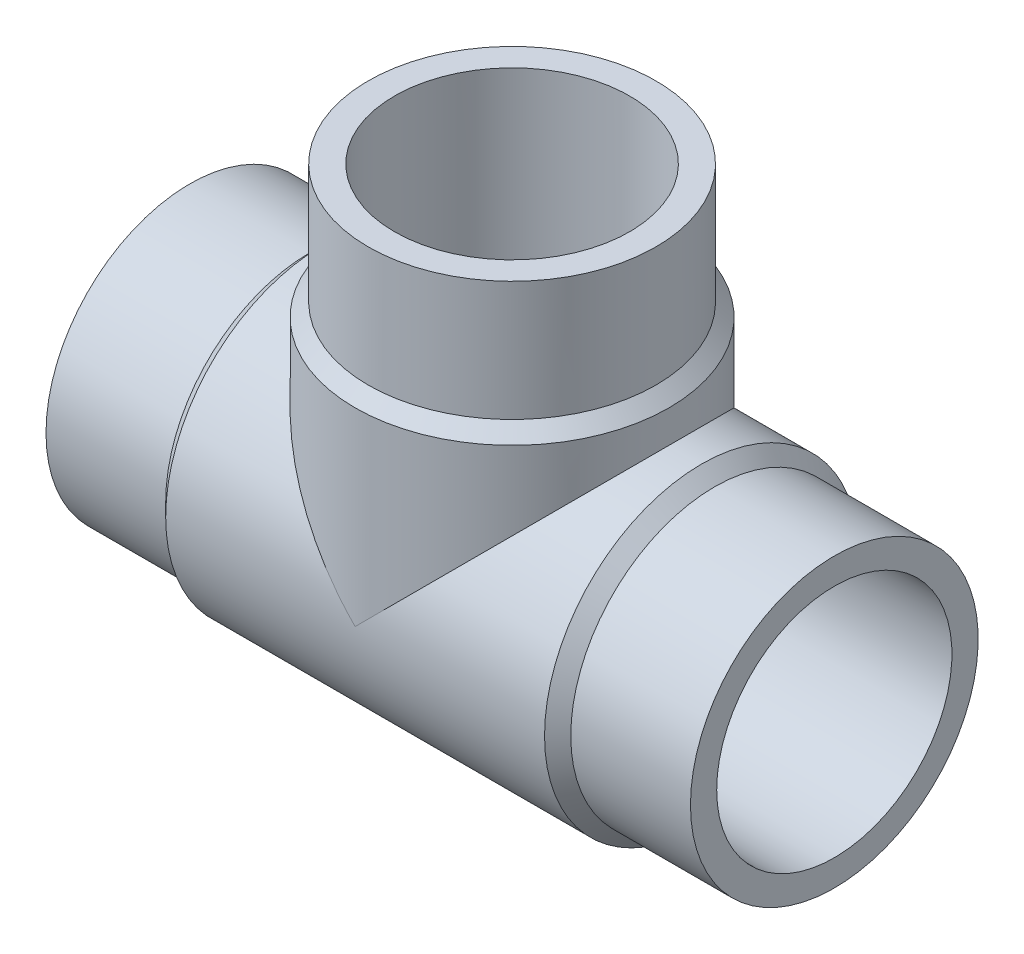
ISO-10303-21;
HEADER;
FILE_DESCRIPTION(('STEP AP214'),'2;1');
FILE_NAME('part.step','',(''),(''),'','','');
FILE_SCHEMA(('AUTOMOTIVE_DESIGN { 1 0 10303 214 1 1 1 1 }'));
ENDSEC;
DATA;
#1=APPLICATION_CONTEXT('core data for automotive mechanical design processes');
#2=APPLICATION_PROTOCOL_DEFINITION('international standard','automotive_design',2000,#1);
#3=PRODUCT_CONTEXT('',#1,'mechanical');
#4=PRODUCT('Part','Part','',(#3));
#5=PRODUCT_RELATED_PRODUCT_CATEGORY('part','',(#4));
#6=PRODUCT_DEFINITION_FORMATION('','',#4);
#7=PRODUCT_DEFINITION_CONTEXT('part definition',#1,'design');
#8=PRODUCT_DEFINITION('design','',#6,#7);
#9=PRODUCT_DEFINITION_SHAPE('','',#8);
#10=(LENGTH_UNIT() NAMED_UNIT(*) SI_UNIT(.MILLI.,.METRE.));
#11=(NAMED_UNIT(*) PLANE_ANGLE_UNIT() SI_UNIT($,.RADIAN.));
#12=(NAMED_UNIT(*) SI_UNIT($,.STERADIAN.) SOLID_ANGLE_UNIT());
#13=UNCERTAINTY_MEASURE_WITH_UNIT(LENGTH_MEASURE(1.E-05),#10,'distance_accuracy_value','');
#14=(GEOMETRIC_REPRESENTATION_CONTEXT(3) GLOBAL_UNCERTAINTY_ASSIGNED_CONTEXT((#13)) GLOBAL_UNIT_ASSIGNED_CONTEXT((#10,
#11,#12)) REPRESENTATION_CONTEXT('',''));
#15=CARTESIAN_POINT('',(0.,0.,0.));
#16=DIRECTION('',(0.,0.,1.));
#17=DIRECTION('',(1.,0.,0.));
#18=AXIS2_PLACEMENT_3D('',#15,#16,#17);
#19=CARTESIAN_POINT('',(-140.,140.,0.));
#20=DIRECTION('',(0.,1.,0.));
#21=DIRECTION('',(0.,0.,1.));
#22=AXIS2_PLACEMENT_3D('',#19,#20,#21);
#23=CYLINDRICAL_SURFACE('',#22,62.5);
#24=CARTESIAN_POINT('',(-140.,140.,0.));
#25=DIRECTION('',(0.,1.,0.));
#26=DIRECTION('',(0.,0.,1.));
#27=AXIS2_PLACEMENT_3D('',#24,#25,#26);
#28=CIRCLE('',#27,62.5);
#29=CARTESIAN_POINT('',(-140.,140.,62.5));
#30=VERTEX_POINT('',#29);
#31=EDGE_CURVE('E18',#30,#30,#28,.T.);
#32=ORIENTED_EDGE('',*,*,#31,.F.);
#33=EDGE_LOOP('',(#32));
#34=FACE_BOUND('',#33,.T.);
#35=CARTESIAN_POINT('',(-140.,88.,0.));
#36=DIRECTION('',(0.,1.,0.));
#37=DIRECTION('',(1.,0.,0.));
#38=AXIS2_PLACEMENT_3D('',#35,#36,#37);
#39=CIRCLE('',#38,62.5);
#40=CARTESIAN_POINT('',(-77.5,88.,0.));
#41=VERTEX_POINT('',#40);
#42=EDGE_CURVE('E71',#41,#41,#39,.F.);
#43=ORIENTED_EDGE('',*,*,#42,.F.);
#44=EDGE_LOOP('',(#43));
#45=FACE_BOUND('',#44,.T.);
#46=ADVANCED_FACE('F15',(#34,#45),#23,.T.);
#47=CARTESIAN_POINT('',(-140.,88.,0.));
#48=DIRECTION('',(0.,-1.,0.));
#49=DIRECTION('',(0.,0.,-1.));
#50=AXIS2_PLACEMENT_3D('',#47,#48,#49);
#51=CONICAL_SURFACE('',#50,62.5,0.785398163397446);
#52=CARTESIAN_POINT('',(-140.,82.3,0.));
#53=DIRECTION('',(0.,1.,0.));
#54=DIRECTION('',(1.,0.,0.));
#55=AXIS2_PLACEMENT_3D('',#52,#53,#54);
#56=CIRCLE('',#55,68.2);
#57=CARTESIAN_POINT('',(-71.8,82.3,0.));
#58=VERTEX_POINT('',#57);
#59=EDGE_CURVE('E60',#58,#58,#56,.F.);
#60=ORIENTED_EDGE('',*,*,#59,.F.);
#61=EDGE_LOOP('',(#60));
#62=FACE_BOUND('',#61,.T.);
#63=ORIENTED_EDGE('',*,*,#42,.T.);
#64=EDGE_LOOP('',(#63));
#65=FACE_BOUND('',#64,.T.);
#66=ADVANCED_FACE('F141',(#62,#65),#51,.T.);
#67=CARTESIAN_POINT('',(-52.,0.,0.));
#68=DIRECTION('',(-1.,0.,0.));
#69=DIRECTION('',(0.,0.,1.));
#70=AXIS2_PLACEMENT_3D('',#67,#68,#69);
#71=CYLINDRICAL_SURFACE('',#70,62.5);
#72=CARTESIAN_POINT('',(-52.,0.,0.));
#73=DIRECTION('',(1.,0.,0.));
#74=DIRECTION('',(0.,1.,0.));
#75=AXIS2_PLACEMENT_3D('',#72,#73,#74);
#76=CIRCLE('',#75,62.5);
#77=CARTESIAN_POINT('',(-52.,62.5,0.));
#78=VERTEX_POINT('',#77);
#79=EDGE_CURVE('E64',#78,#78,#76,.F.);
#80=ORIENTED_EDGE('',*,*,#79,.F.);
#81=EDGE_LOOP('',(#80));
#82=FACE_BOUND('',#81,.T.);
#83=CARTESIAN_POINT('',(0.,0.,0.));
#84=DIRECTION('',(-1.,0.,0.));
#85=DIRECTION('',(0.,0.,1.));
#86=AXIS2_PLACEMENT_3D('',#83,#84,#85);
#87=CIRCLE('',#86,62.5);
#88=CARTESIAN_POINT('',(0.,0.,62.5));
#89=VERTEX_POINT('',#88);
#90=EDGE_CURVE('E58',#89,#89,#87,.F.);
#91=ORIENTED_EDGE('',*,*,#90,.F.);
#92=EDGE_LOOP('',(#91));
#93=FACE_BOUND('',#92,.T.);
#94=ADVANCED_FACE('F136',(#82,#93),#71,.T.);
#95=CARTESIAN_POINT('',(-202.5,140.,63.2500021080511));
#96=DIRECTION('',(0.,1.,0.));
#97=DIRECTION('',(1.,0.,0.));
#98=AXIS2_PLACEMENT_3D('',#95,#96,#97);
#99=PLANE('',#98);
#100=CARTESIAN_POINT('',(-140.,140.,0.));
#101=DIRECTION('',(0.,1.,0.));
#102=DIRECTION('',(0.,0.,1.));
#103=AXIS2_PLACEMENT_3D('',#100,#101,#102);
#104=CIRCLE('',#103,51.1);
#105=CARTESIAN_POINT('',(-140.,140.,51.1));
#106=VERTEX_POINT('',#105);
#107=EDGE_CURVE('E52',#106,#106,#104,.T.);
#108=ORIENTED_EDGE('',*,*,#107,.F.);
#109=EDGE_LOOP('',(#108));
#110=FACE_BOUND('',#109,.T.);
#111=ORIENTED_EDGE('',*,*,#31,.T.);
#112=EDGE_LOOP('',(#111));
#113=FACE_BOUND('',#112,.T.);
#114=ADVANCED_FACE('F130',(#110,#113),#99,.T.);
#115=CARTESIAN_POINT('',(-52.,0.,0.));
#116=DIRECTION('',(-1.,0.,0.));
#117=DIRECTION('',(0.,0.,1.));
#118=AXIS2_PLACEMENT_3D('',#115,#116,#117);
#119=CONICAL_SURFACE('',#118,62.5,0.78539816339745);
#120=ORIENTED_EDGE('',*,*,#79,.T.);
#121=EDGE_LOOP('',(#120));
#122=FACE_BOUND('',#121,.T.);
#123=CARTESIAN_POINT('',(-57.7,0.,0.));
#124=DIRECTION('',(-1.,0.,0.));
#125=DIRECTION('',(0.,1.,0.));
#126=AXIS2_PLACEMENT_3D('',#123,#124,#125);
#127=CIRCLE('',#126,68.2);
#128=CARTESIAN_POINT('',(-57.7,68.2,0.));
#129=VERTEX_POINT('',#128);
#130=EDGE_CURVE('E49',#129,#129,#127,.T.);
#131=ORIENTED_EDGE('',*,*,#130,.F.);
#132=EDGE_LOOP('',(#131));
#133=FACE_BOUND('',#132,.T.);
#134=ADVANCED_FACE('F95',(#122,#133),#119,.T.);
#135=CARTESIAN_POINT('',(-140.,82.3,0.));
#136=DIRECTION('',(0.,1.,0.));
#137=DIRECTION('',(0.,0.,1.));
#138=AXIS2_PLACEMENT_3D('',#135,#136,#137);
#139=CYLINDRICAL_SURFACE('',#138,68.2);
#140=CARTESIAN_POINT('',(-140.,0.,0.));
#141=DIRECTION('',(0.707106781186547,0.707106781186547,0.));
#142=DIRECTION('',(-0.707106781186547,0.707106781186547,0.));
#143=AXIS2_PLACEMENT_3D('',#140,#141,#142);
#144=ELLIPSE('',#143,96.4493649538451,68.2);
#145=CARTESIAN_POINT('',(-140.,0.,68.2));
#146=VERTEX_POINT('',#145);
#147=CARTESIAN_POINT('',(-140.,0.,-68.2));
#148=VERTEX_POINT('',#147);
#149=EDGE_CURVE('E44',#146,#148,#144,.F.);
#150=ORIENTED_EDGE('',*,*,#149,.F.);
#151=CARTESIAN_POINT('',(-140.,0.,0.));
#152=DIRECTION('',(-0.707106781186547,0.707106781186547,0.));
#153=DIRECTION('',(-0.707106781186547,-0.707106781186547,0.));
#154=AXIS2_PLACEMENT_3D('',#151,#152,#153);
#155=ELLIPSE('',#154,96.4493649538451,68.2);
#156=EDGE_CURVE('E40',#148,#146,#155,.F.);
#157=ORIENTED_EDGE('',*,*,#156,.F.);
#158=EDGE_LOOP('',(#150,#157));
#159=FACE_BOUND('',#158,.T.);
#160=ORIENTED_EDGE('',*,*,#59,.T.);
#161=EDGE_LOOP('',(#160));
#162=FACE_BOUND('',#161,.T.);
#163=ADVANCED_FACE('F47',(#159,#162),#139,.T.);
#164=CARTESIAN_POINT('',(0.,62.5,63.2500021084614));
#165=DIRECTION('',(1.,0.,0.));
#166=DIRECTION('',(0.,-1.,0.));
#167=AXIS2_PLACEMENT_3D('',#164,#165,#166);
#168=PLANE('',#167);
#169=CARTESIAN_POINT('',(0.,0.,0.));
#170=DIRECTION('',(-1.,0.,0.));
#171=DIRECTION('',(0.,0.,1.));
#172=AXIS2_PLACEMENT_3D('',#169,#170,#171);
#173=CIRCLE('',#172,51.1);
#174=CARTESIAN_POINT('',(0.,0.,51.1));
#175=VERTEX_POINT('',#174);
#176=EDGE_CURVE('E45',#175,#175,#173,.F.);
#177=ORIENTED_EDGE('',*,*,#176,.F.);
#178=EDGE_LOOP('',(#177));
#179=FACE_BOUND('',#178,.T.);
#180=ORIENTED_EDGE('',*,*,#90,.T.);
#181=EDGE_LOOP('',(#180));
#182=FACE_BOUND('',#181,.T.);
#183=ADVANCED_FACE('F85',(#179,#182),#168,.T.);
#184=CARTESIAN_POINT('',(-140.,0.,0.));
#185=DIRECTION('',(0.,1.,0.));
#186=DIRECTION('',(0.,0.,1.));
#187=AXIS2_PLACEMENT_3D('',#184,#185,#186);
#188=CYLINDRICAL_SURFACE('',#187,51.1);
#189=CARTESIAN_POINT('',(-140.,0.,0.));
#190=DIRECTION('',(-0.707106781186547,-0.707106781186547,0.));
#191=DIRECTION('',(-0.707106781186547,0.707106781186547,0.));
#192=AXIS2_PLACEMENT_3D('',#189,#190,#191);
#193=ELLIPSE('',#192,72.2663130372651,51.1);
#194=CARTESIAN_POINT('',(-140.,0.,-51.1));
#195=VERTEX_POINT('',#194);
#196=CARTESIAN_POINT('',(-140.,0.,51.1));
#197=VERTEX_POINT('',#196);
#198=EDGE_CURVE('E78',#195,#197,#193,.F.);
#199=ORIENTED_EDGE('',*,*,#198,.F.);
#200=CARTESIAN_POINT('',(-140.,0.,0.));
#201=DIRECTION('',(-0.707106781186547,0.707106781186547,0.));
#202=DIRECTION('',(0.707106781186547,0.707106781186547,0.));
#203=AXIS2_PLACEMENT_3D('',#200,#201,#202);
#204=ELLIPSE('',#203,72.2663130372651,51.1);
#205=EDGE_CURVE('E32',#195,#197,#204,.F.);
#206=ORIENTED_EDGE('',*,*,#205,.T.);
#207=EDGE_LOOP('',(#199,#206));
#208=FACE_BOUND('',#207,.T.);
#209=ORIENTED_EDGE('',*,*,#107,.T.);
#210=EDGE_LOOP('',(#209));
#211=FACE_BOUND('',#210,.T.);
#212=ADVANCED_FACE('F87',(#208,#211),#188,.F.);
#213=CARTESIAN_POINT('',(-222.3,0.,0.));
#214=DIRECTION('',(-1.,0.,0.));
#215=DIRECTION('',(0.,0.,1.));
#216=AXIS2_PLACEMENT_3D('',#213,#214,#215);
#217=CYLINDRICAL_SURFACE('',#216,68.2);
#218=ORIENTED_EDGE('',*,*,#130,.T.);
#219=EDGE_LOOP('',(#218));
#220=FACE_BOUND('',#219,.T.);
#221=CARTESIAN_POINT('',(-222.3,0.,0.));
#222=DIRECTION('',(-1.,0.,0.));
#223=DIRECTION('',(0.,1.,0.));
#224=AXIS2_PLACEMENT_3D('',#221,#222,#223);
#225=CIRCLE('',#224,68.2);
#226=CARTESIAN_POINT('',(-222.3,68.2,0.));
#227=VERTEX_POINT('',#226);
#228=EDGE_CURVE('E77',#227,#227,#225,.T.);
#229=ORIENTED_EDGE('',*,*,#228,.F.);
#230=EDGE_LOOP('',(#229));
#231=FACE_BOUND('',#230,.T.);
#232=ORIENTED_EDGE('',*,*,#149,.T.);
#233=ORIENTED_EDGE('',*,*,#156,.T.);
#234=EDGE_LOOP('',(#232,#233));
#235=FACE_BOUND('',#234,.T.);
#236=ADVANCED_FACE('F43',(#220,#231,#235),#217,.T.);
#237=CARTESIAN_POINT('',(-140.,0.,0.));
#238=DIRECTION('',(-1.,0.,0.));
#239=DIRECTION('',(0.,0.,1.));
#240=AXIS2_PLACEMENT_3D('',#237,#238,#239);
#241=CYLINDRICAL_SURFACE('',#240,51.1);
#242=ORIENTED_EDGE('',*,*,#205,.F.);
#243=ORIENTED_EDGE('',*,*,#198,.T.);
#244=EDGE_LOOP('',(#242,#243));
#245=FACE_BOUND('',#244,.T.);
#246=ORIENTED_EDGE('',*,*,#176,.T.);
#247=EDGE_LOOP('',(#246));
#248=FACE_BOUND('',#247,.T.);
#249=CARTESIAN_POINT('',(-280.,0.,0.));
#250=DIRECTION('',(-1.,0.,0.));
#251=DIRECTION('',(0.,0.,1.));
#252=AXIS2_PLACEMENT_3D('',#249,#250,#251);
#253=CIRCLE('',#252,51.1);
#254=CARTESIAN_POINT('',(-280.,0.,51.1));
#255=VERTEX_POINT('',#254);
#256=EDGE_CURVE('E74',#255,#255,#253,.F.);
#257=ORIENTED_EDGE('',*,*,#256,.F.);
#258=EDGE_LOOP('',(#257));
#259=FACE_BOUND('',#258,.T.);
#260=ADVANCED_FACE('F82',(#245,#248,#259),#241,.F.);
#261=CARTESIAN_POINT('',(-228.,0.,0.));
#262=DIRECTION('',(1.,0.,0.));
#263=DIRECTION('',(0.,0.,-1.));
#264=AXIS2_PLACEMENT_3D('',#261,#262,#263);
#265=CONICAL_SURFACE('',#264,62.5,0.78539816339745);
#266=ORIENTED_EDGE('',*,*,#228,.T.);
#267=EDGE_LOOP('',(#266));
#268=FACE_BOUND('',#267,.T.);
#269=CARTESIAN_POINT('',(-228.,0.,0.));
#270=DIRECTION('',(-1.,0.,0.));
#271=DIRECTION('',(0.,1.,0.));
#272=AXIS2_PLACEMENT_3D('',#269,#270,#271);
#273=CIRCLE('',#272,62.5);
#274=CARTESIAN_POINT('',(-228.,62.5,0.));
#275=VERTEX_POINT('',#274);
#276=EDGE_CURVE('E24',#275,#275,#273,.T.);
#277=ORIENTED_EDGE('',*,*,#276,.F.);
#278=EDGE_LOOP('',(#277));
#279=FACE_BOUND('',#278,.T.);
#280=ADVANCED_FACE('F105',(#268,#279),#265,.T.);
#281=CARTESIAN_POINT('',(-280.,-62.5,63.2500021080524));
#282=DIRECTION('',(-1.,0.,0.));
#283=DIRECTION('',(0.,1.,0.));
#284=AXIS2_PLACEMENT_3D('',#281,#282,#283);
#285=PLANE('',#284);
#286=ORIENTED_EDGE('',*,*,#256,.T.);
#287=EDGE_LOOP('',(#286));
#288=FACE_BOUND('',#287,.T.);
#289=CARTESIAN_POINT('',(-280.,0.,0.));
#290=DIRECTION('',(-1.,0.,0.));
#291=DIRECTION('',(0.,0.,1.));
#292=AXIS2_PLACEMENT_3D('',#289,#290,#291);
#293=CIRCLE('',#292,62.5);
#294=CARTESIAN_POINT('',(-280.,0.,62.5));
#295=VERTEX_POINT('',#294);
#296=EDGE_CURVE('E9',#295,#295,#293,.F.);
#297=ORIENTED_EDGE('',*,*,#296,.F.);
#298=EDGE_LOOP('',(#297));
#299=FACE_BOUND('',#298,.T.);
#300=ADVANCED_FACE('F99',(#288,#299),#285,.T.);
#301=CARTESIAN_POINT('',(-280.,0.,0.));
#302=DIRECTION('',(-1.,0.,0.));
#303=DIRECTION('',(0.,0.,1.));
#304=AXIS2_PLACEMENT_3D('',#301,#302,#303);
#305=CYLINDRICAL_SURFACE('',#304,62.5);
#306=ORIENTED_EDGE('',*,*,#276,.T.);
#307=EDGE_LOOP('',(#306));
#308=FACE_BOUND('',#307,.T.);
#309=ORIENTED_EDGE('',*,*,#296,.T.);
#310=EDGE_LOOP('',(#309));
#311=FACE_BOUND('',#310,.T.);
#312=ADVANCED_FACE('F97',(#308,#311),#305,.T.);
#313=CLOSED_SHELL('',(#46,#66,#94,#114,#134,#163,#183,#212,#236,#260,#280,#300,#312));
#314=MANIFOLD_SOLID_BREP('B1',#313);
#315=ADVANCED_BREP_SHAPE_REPRESENTATION('',(#18,#314),#14);
#316=SHAPE_DEFINITION_REPRESENTATION(#9,#315);
ENDSEC;
END-ISO-10303-21;
